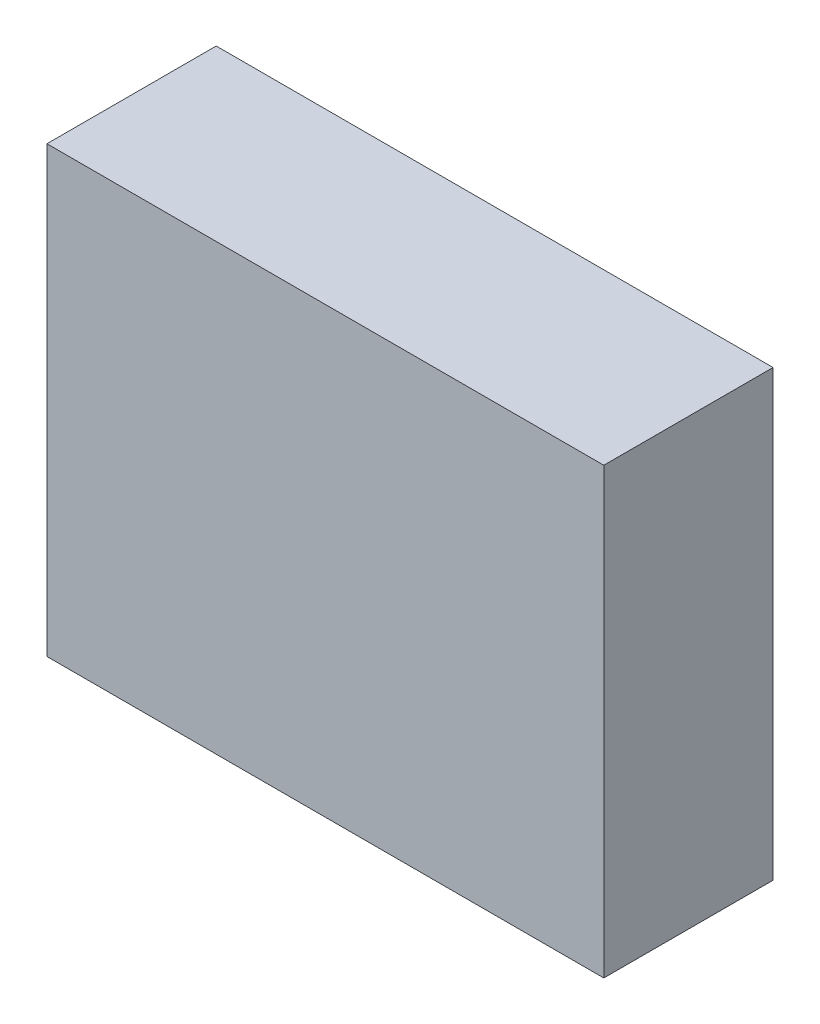
ISO-10303-21;
HEADER;
FILE_DESCRIPTION(('STEP AP214'),'2;1');
FILE_NAME('part.step','',(''),(''),'','','');
FILE_SCHEMA(('AUTOMOTIVE_DESIGN { 1 0 10303 214 1 1 1 1 }'));
ENDSEC;
DATA;
#1=APPLICATION_CONTEXT('core data for automotive mechanical design processes');
#2=APPLICATION_PROTOCOL_DEFINITION('international standard','automotive_design',2000,#1);
#3=PRODUCT_CONTEXT('',#1,'mechanical');
#4=PRODUCT('Part','Part','',(#3));
#5=PRODUCT_RELATED_PRODUCT_CATEGORY('part','',(#4));
#6=PRODUCT_DEFINITION_FORMATION('','',#4);
#7=PRODUCT_DEFINITION_CONTEXT('part definition',#1,'design');
#8=PRODUCT_DEFINITION('design','',#6,#7);
#9=PRODUCT_DEFINITION_SHAPE('','',#8);
#10=(LENGTH_UNIT() NAMED_UNIT(*) SI_UNIT(.MILLI.,.METRE.));
#11=(NAMED_UNIT(*) PLANE_ANGLE_UNIT() SI_UNIT($,.RADIAN.));
#12=(NAMED_UNIT(*) SI_UNIT($,.STERADIAN.) SOLID_ANGLE_UNIT());
#13=UNCERTAINTY_MEASURE_WITH_UNIT(LENGTH_MEASURE(1.E-05),#10,'distance_accuracy_value','');
#14=(GEOMETRIC_REPRESENTATION_CONTEXT(3) GLOBAL_UNCERTAINTY_ASSIGNED_CONTEXT((#13)) GLOBAL_UNIT_ASSIGNED_CONTEXT((#10,
#11,#12)) REPRESENTATION_CONTEXT('',''));
#15=CARTESIAN_POINT('',(0.,0.,0.));
#16=DIRECTION('',(0.,0.,1.));
#17=DIRECTION('',(1.,0.,0.));
#18=AXIS2_PLACEMENT_3D('',#15,#16,#17);
#19=CARTESIAN_POINT('',(-1.0033,-0.8001,0.61));
#20=DIRECTION('',(0.,0.,-1.));
#21=DIRECTION('',(-1.,0.,0.));
#22=AXIS2_PLACEMENT_3D('',#19,#20,#21);
#23=PLANE('',#22);
#24=DIRECTION('',(0.,1.,0.));
#25=VECTOR('',#24,1.);
#26=CARTESIAN_POINT('',(1.0033,-0.8001,0.61));
#27=LINE('',#26,#25);
#28=CARTESIAN_POINT('',(1.0033,-0.8001,0.61));
#29=VERTEX_POINT('',#28);
#30=CARTESIAN_POINT('',(1.0033,0.8001,0.61));
#31=VERTEX_POINT('',#30);
#32=EDGE_CURVE('E54',#29,#31,#27,.T.);
#33=ORIENTED_EDGE('',*,*,#32,.T.);
#34=DIRECTION('',(1.,0.,0.));
#35=VECTOR('',#34,1.);
#36=CARTESIAN_POINT('',(1.0033,0.8001,0.61));
#37=LINE('',#36,#35);
#38=CARTESIAN_POINT('',(-1.0033,0.8001,0.61));
#39=VERTEX_POINT('',#38);
#40=EDGE_CURVE('E56',#31,#39,#37,.F.);
#41=ORIENTED_EDGE('',*,*,#40,.T.);
#42=DIRECTION('',(0.,1.,0.));
#43=VECTOR('',#42,1.);
#44=CARTESIAN_POINT('',(-1.0033,0.8001,0.61));
#45=LINE('',#44,#43);
#46=CARTESIAN_POINT('',(-1.0033,-0.8001,0.61));
#47=VERTEX_POINT('',#46);
#48=EDGE_CURVE('E19',#39,#47,#45,.F.);
#49=ORIENTED_EDGE('',*,*,#48,.T.);
#50=DIRECTION('',(1.,0.,0.));
#51=VECTOR('',#50,1.);
#52=CARTESIAN_POINT('',(-1.0033,-0.8001,0.61));
#53=LINE('',#52,#51);
#54=EDGE_CURVE('E79',#47,#29,#53,.T.);
#55=ORIENTED_EDGE('',*,*,#54,.T.);
#56=EDGE_LOOP('',(#33,#41,#49,#55));
#57=FACE_BOUND('',#56,.T.);
#58=ADVANCED_FACE('F16',(#57),#23,.F.);
#59=CARTESIAN_POINT('',(-1.0033,0.8001,0.));
#60=DIRECTION('',(1.,0.,0.));
#61=DIRECTION('',(0.,0.,-1.));
#62=AXIS2_PLACEMENT_3D('',#59,#60,#61);
#63=PLANE('',#62);
#64=DIRECTION('',(0.,0.,1.));
#65=VECTOR('',#64,1.);
#66=CARTESIAN_POINT('',(-1.0033,-0.8001,0.));
#67=LINE('',#66,#65);
#68=CARTESIAN_POINT('',(-1.0033,-0.8001,0.));
#69=VERTEX_POINT('',#68);
#70=EDGE_CURVE('E67',#69,#47,#67,.T.);
#71=ORIENTED_EDGE('',*,*,#70,.T.);
#72=ORIENTED_EDGE('',*,*,#48,.F.);
#73=DIRECTION('',(0.,0.,-1.));
#74=VECTOR('',#73,1.);
#75=CARTESIAN_POINT('',(-1.0033,0.8001,0.));
#76=LINE('',#75,#74);
#77=CARTESIAN_POINT('',(-1.0033,0.8001,0.));
#78=VERTEX_POINT('',#77);
#79=EDGE_CURVE('E62',#39,#78,#76,.T.);
#80=ORIENTED_EDGE('',*,*,#79,.T.);
#81=DIRECTION('',(0.,1.,0.));
#82=VECTOR('',#81,1.);
#83=CARTESIAN_POINT('',(-1.0033,-0.8001,0.));
#84=LINE('',#83,#82);
#85=EDGE_CURVE('E82',#69,#78,#84,.T.);
#86=ORIENTED_EDGE('',*,*,#85,.F.);
#87=EDGE_LOOP('',(#71,#72,#80,#86));
#88=FACE_BOUND('',#87,.T.);
#89=ADVANCED_FACE('F64',(#88),#63,.F.);
#90=CARTESIAN_POINT('',(1.0033,0.8001,0.));
#91=DIRECTION('',(0.,-1.,0.));
#92=DIRECTION('',(0.,0.,-1.));
#93=AXIS2_PLACEMENT_3D('',#90,#91,#92);
#94=PLANE('',#93);
#95=ORIENTED_EDGE('',*,*,#79,.F.);
#96=ORIENTED_EDGE('',*,*,#40,.F.);
#97=DIRECTION('',(0.,0.,1.));
#98=VECTOR('',#97,1.);
#99=CARTESIAN_POINT('',(1.0033,0.8001,0.));
#100=LINE('',#99,#98);
#101=CARTESIAN_POINT('',(1.0033,0.8001,0.));
#102=VERTEX_POINT('',#101);
#103=EDGE_CURVE('E74',#31,#102,#100,.F.);
#104=ORIENTED_EDGE('',*,*,#103,.T.);
#105=DIRECTION('',(-1.,0.,0.));
#106=VECTOR('',#105,1.);
#107=CARTESIAN_POINT('',(-1.0033,0.8001,0.));
#108=LINE('',#107,#106);
#109=EDGE_CURVE('E71',#78,#102,#108,.F.);
#110=ORIENTED_EDGE('',*,*,#109,.F.);
#111=EDGE_LOOP('',(#95,#96,#104,#110));
#112=FACE_BOUND('',#111,.T.);
#113=ADVANCED_FACE('F69',(#112),#94,.F.);
#114=CARTESIAN_POINT('',(1.0033,-0.8001,0.));
#115=DIRECTION('',(-1.,0.,0.));
#116=DIRECTION('',(0.,0.,1.));
#117=AXIS2_PLACEMENT_3D('',#114,#115,#116);
#118=PLANE('',#117);
#119=ORIENTED_EDGE('',*,*,#103,.F.);
#120=ORIENTED_EDGE('',*,*,#32,.F.);
#121=DIRECTION('',(0.,0.,1.));
#122=VECTOR('',#121,1.);
#123=CARTESIAN_POINT('',(1.0033,-0.8001,0.));
#124=LINE('',#123,#122);
#125=CARTESIAN_POINT('',(1.0033,-0.8001,0.));
#126=VERTEX_POINT('',#125);
#127=EDGE_CURVE('E34',#29,#126,#124,.F.);
#128=ORIENTED_EDGE('',*,*,#127,.T.);
#129=DIRECTION('',(0.,1.,0.));
#130=VECTOR('',#129,1.);
#131=CARTESIAN_POINT('',(1.0033,-0.8001,0.));
#132=LINE('',#131,#130);
#133=EDGE_CURVE('E25',#102,#126,#132,.F.);
#134=ORIENTED_EDGE('',*,*,#133,.F.);
#135=EDGE_LOOP('',(#119,#120,#128,#134));
#136=FACE_BOUND('',#135,.T.);
#137=ADVANCED_FACE('F88',(#136),#118,.F.);
#138=CARTESIAN_POINT('',(-1.0033,-0.8001,0.));
#139=DIRECTION('',(0.,1.,0.));
#140=DIRECTION('',(0.,0.,1.));
#141=AXIS2_PLACEMENT_3D('',#138,#139,#140);
#142=PLANE('',#141);
#143=ORIENTED_EDGE('',*,*,#127,.F.);
#144=ORIENTED_EDGE('',*,*,#54,.F.);
#145=ORIENTED_EDGE('',*,*,#70,.F.);
#146=DIRECTION('',(-1.,0.,0.));
#147=VECTOR('',#146,1.);
#148=CARTESIAN_POINT('',(-1.0033,-0.8001,0.));
#149=LINE('',#148,#147);
#150=EDGE_CURVE('E10',#126,#69,#149,.T.);
#151=ORIENTED_EDGE('',*,*,#150,.F.);
#152=EDGE_LOOP('',(#143,#144,#145,#151));
#153=FACE_BOUND('',#152,.T.);
#154=ADVANCED_FACE('F90',(#153),#142,.F.);
#155=CARTESIAN_POINT('',(-1.0033,-0.8001,0.));
#156=DIRECTION('',(0.,0.,-1.));
#157=DIRECTION('',(-1.,0.,0.));
#158=AXIS2_PLACEMENT_3D('',#155,#156,#157);
#159=PLANE('',#158);
#160=ORIENTED_EDGE('',*,*,#133,.T.);
#161=ORIENTED_EDGE('',*,*,#150,.T.);
#162=ORIENTED_EDGE('',*,*,#85,.T.);
#163=ORIENTED_EDGE('',*,*,#109,.T.);
#164=EDGE_LOOP('',(#160,#161,#162,#163));
#165=FACE_BOUND('',#164,.T.);
#166=ADVANCED_FACE('F87',(#165),#159,.T.);
#167=CLOSED_SHELL('',(#58,#89,#113,#137,#154,#166));
#168=MANIFOLD_SOLID_BREP('B1',#167);
#169=ADVANCED_BREP_SHAPE_REPRESENTATION('',(#18,#168),#14);
#170=SHAPE_DEFINITION_REPRESENTATION(#9,#169);
ENDSEC;
END-ISO-10303-21;
